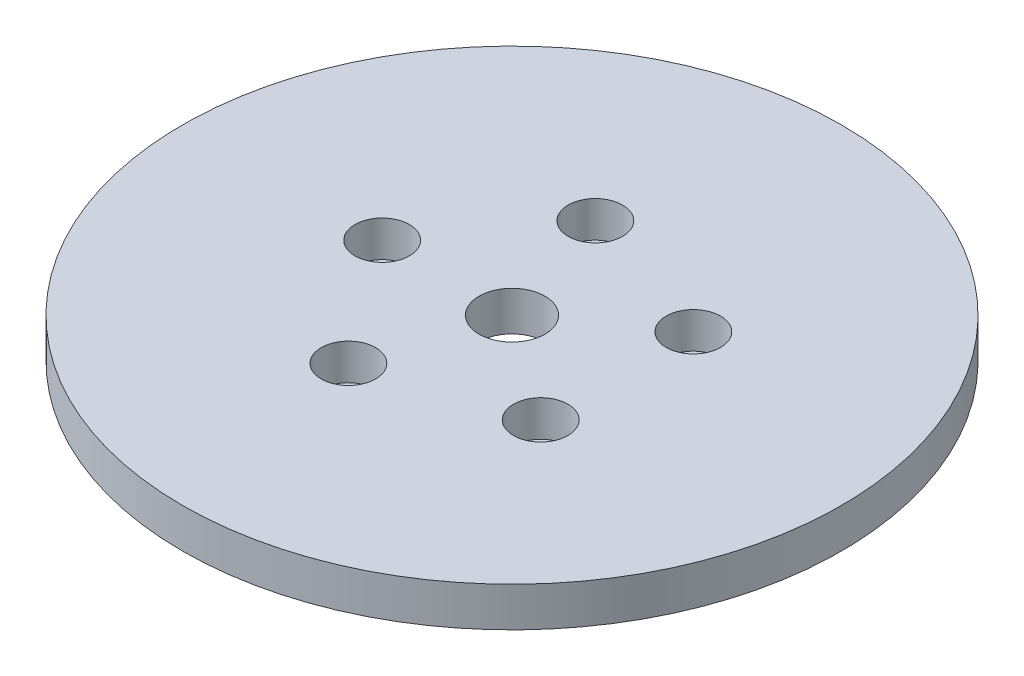
ISO-10303-21;
HEADER;
FILE_DESCRIPTION(('STEP AP214'),'2;1');
FILE_NAME('part.step','',(''),(''),'','','');
FILE_SCHEMA(('AUTOMOTIVE_DESIGN { 1 0 10303 214 1 1 1 1 }'));
ENDSEC;
DATA;
#1=APPLICATION_CONTEXT('core data for automotive mechanical design processes');
#2=APPLICATION_PROTOCOL_DEFINITION('international standard','automotive_design',2000,#1);
#3=PRODUCT_CONTEXT('',#1,'mechanical');
#4=PRODUCT('Part','Part','',(#3));
#5=PRODUCT_RELATED_PRODUCT_CATEGORY('part','',(#4));
#6=PRODUCT_DEFINITION_FORMATION('','',#4);
#7=PRODUCT_DEFINITION_CONTEXT('part definition',#1,'design');
#8=PRODUCT_DEFINITION('design','',#6,#7);
#9=PRODUCT_DEFINITION_SHAPE('','',#8);
#10=(LENGTH_UNIT() NAMED_UNIT(*) SI_UNIT(.MILLI.,.METRE.));
#11=(NAMED_UNIT(*) PLANE_ANGLE_UNIT() SI_UNIT($,.RADIAN.));
#12=(NAMED_UNIT(*) SI_UNIT($,.STERADIAN.) SOLID_ANGLE_UNIT());
#13=UNCERTAINTY_MEASURE_WITH_UNIT(LENGTH_MEASURE(1.E-05),#10,'distance_accuracy_value','');
#14=(GEOMETRIC_REPRESENTATION_CONTEXT(3) GLOBAL_UNCERTAINTY_ASSIGNED_CONTEXT((#13)) GLOBAL_UNIT_ASSIGNED_CONTEXT((#10,
#11,#12)) REPRESENTATION_CONTEXT('',''));
#15=CARTESIAN_POINT('',(0.,0.,0.));
#16=DIRECTION('',(0.,0.,1.));
#17=DIRECTION('',(1.,0.,0.));
#18=AXIS2_PLACEMENT_3D('',#15,#16,#17);
#19=CARTESIAN_POINT('',(0.,12.,0.));
#20=DIRECTION('',(0.,-1.,0.));
#21=DIRECTION('',(0.,0.,-1.));
#22=AXIS2_PLACEMENT_3D('',#19,#20,#21);
#23=CYLINDRICAL_SURFACE('',#22,100.);
#24=CARTESIAN_POINT('',(0.,12.,0.));
#25=DIRECTION('',(0.,1.,0.));
#26=DIRECTION('',(0.,0.,1.));
#27=AXIS2_PLACEMENT_3D('',#24,#25,#26);
#28=CIRCLE('',#27,100.);
#29=CARTESIAN_POINT('',(0.,12.,100.));
#30=VERTEX_POINT('',#29);
#31=EDGE_CURVE('E10',#30,#30,#28,.T.);
#32=ORIENTED_EDGE('',*,*,#31,.F.);
#33=EDGE_LOOP('',(#32));
#34=FACE_BOUND('',#33,.T.);
#35=CARTESIAN_POINT('',(0.,0.,0.));
#36=DIRECTION('',(0.,1.,0.));
#37=DIRECTION('',(0.,0.,1.));
#38=AXIS2_PLACEMENT_3D('',#35,#36,#37);
#39=CIRCLE('',#38,100.);
#40=CARTESIAN_POINT('',(0.,0.,100.));
#41=VERTEX_POINT('',#40);
#42=EDGE_CURVE('E37',#41,#41,#39,.T.);
#43=ORIENTED_EDGE('',*,*,#42,.T.);
#44=EDGE_LOOP('',(#43));
#45=FACE_BOUND('',#44,.T.);
#46=ADVANCED_FACE('F40',(#34,#45),#23,.T.);
#47=CARTESIAN_POINT('',(0.,12.,0.));
#48=DIRECTION('',(0.,1.,0.));
#49=DIRECTION('',(0.,0.,1.));
#50=AXIS2_PLACEMENT_3D('',#47,#48,#49);
#51=PLANE('',#50);
#52=CARTESIAN_POINT('',(-12.1738231960605,12.,-37.4671752349962));
#53=DIRECTION('',(0.,1.,0.));
#54=DIRECTION('',(-0.95105651629515,0.,0.309016994374958));
#55=AXIS2_PLACEMENT_3D('',#52,#53,#54);
#56=CIRCLE('',#55,8.24918257245908);
#57=CARTESIAN_POINT('',(-20.0192620357061,12.,-34.9180376304046));
#58=VERTEX_POINT('',#57);
#59=EDGE_CURVE('E70',#58,#58,#56,.T.);
#60=ORIENTED_EDGE('',*,*,#59,.F.);
#61=EDGE_LOOP('',(#60));
#62=FACE_BOUND('',#61,.T.);
#63=CARTESIAN_POINT('',(31.8714829003169,12.,-23.1559877576763));
#64=DIRECTION('',(0.,1.,0.));
#65=DIRECTION('',(-0.58778525229248,0.,-0.809016994374942));
#66=AXIS2_PLACEMENT_3D('',#63,#64,#65);
#67=CIRCLE('',#66,8.24918257245908);
#68=CARTESIAN_POINT('',(27.0227350407573,12.,-29.8297166484973));
#69=VERTEX_POINT('',#68);
#70=EDGE_CURVE('E71',#69,#69,#67,.T.);
#71=ORIENTED_EDGE('',*,*,#70,.F.);
#72=EDGE_LOOP('',(#71));
#73=FACE_BOUND('',#72,.T.);
#74=CARTESIAN_POINT('',(31.8714829003173,12.,23.1559877576759));
#75=DIRECTION('',(0.,1.,0.));
#76=DIRECTION('',(0.587785252292469,0.,-0.809016994374951));
#77=AXIS2_PLACEMENT_3D('',#74,#75,#76);
#78=CIRCLE('',#77,8.24918257245908);
#79=CARTESIAN_POINT('',(36.7202307598767,12.,16.4822588668548));
#80=VERTEX_POINT('',#79);
#81=EDGE_CURVE('E78',#80,#80,#78,.T.);
#82=ORIENTED_EDGE('',*,*,#81,.F.);
#83=EDGE_LOOP('',(#82));
#84=FACE_BOUND('',#83,.T.);
#85=CARTESIAN_POINT('',(-12.17382319606,12.,37.4671752349963));
#86=DIRECTION('',(0.,1.,0.));
#87=DIRECTION('',(0.951056516295155,0.,0.309016994374945));
#88=AXIS2_PLACEMENT_3D('',#85,#86,#87);
#89=CIRCLE('',#88,8.24918257245908);
#90=CARTESIAN_POINT('',(-4.32838435641433,12.,40.0163128395878));
#91=VERTEX_POINT('',#90);
#92=EDGE_CURVE('E61',#91,#91,#89,.T.);
#93=ORIENTED_EDGE('',*,*,#92,.F.);
#94=EDGE_LOOP('',(#93));
#95=FACE_BOUND('',#94,.T.);
#96=CARTESIAN_POINT('',(-39.3953194085141,12.,0.));
#97=DIRECTION('',(0.,1.,0.));
#98=DIRECTION('',(0.,0.,1.));
#99=AXIS2_PLACEMENT_3D('',#96,#97,#98);
#100=CIRCLE('',#99,8.24918257245908);
#101=CARTESIAN_POINT('',(-39.3953194085141,12.,8.24918257245908));
#102=VERTEX_POINT('',#101);
#103=EDGE_CURVE('E54',#102,#102,#100,.T.);
#104=ORIENTED_EDGE('',*,*,#103,.F.);
#105=EDGE_LOOP('',(#104));
#106=FACE_BOUND('',#105,.T.);
#107=CARTESIAN_POINT('',(0.,12.,0.));
#108=DIRECTION('',(0.,1.,0.));
#109=DIRECTION('',(0.,0.,1.));
#110=AXIS2_PLACEMENT_3D('',#107,#108,#109);
#111=CIRCLE('',#110,10.);
#112=CARTESIAN_POINT('',(0.,12.,10.));
#113=VERTEX_POINT('',#112);
#114=EDGE_CURVE('E50',#113,#113,#111,.T.);
#115=ORIENTED_EDGE('',*,*,#114,.F.);
#116=EDGE_LOOP('',(#115));
#117=FACE_BOUND('',#116,.T.);
#118=ORIENTED_EDGE('',*,*,#31,.T.);
#119=EDGE_LOOP('',(#118));
#120=FACE_BOUND('',#119,.T.);
#121=ADVANCED_FACE('F94',(#62,#73,#84,#95,#106,#117,#120),#51,.T.);
#122=CARTESIAN_POINT('',(0.,0.,0.));
#123=DIRECTION('',(0.,1.,0.));
#124=DIRECTION('',(0.,0.,1.));
#125=AXIS2_PLACEMENT_3D('',#122,#123,#124);
#126=PLANE('',#125);
#127=CARTESIAN_POINT('',(0.,0.,0.));
#128=DIRECTION('',(0.,1.,0.));
#129=DIRECTION('',(0.,0.,1.));
#130=AXIS2_PLACEMENT_3D('',#127,#128,#129);
#131=CIRCLE('',#130,10.);
#132=CARTESIAN_POINT('',(0.,0.,10.));
#133=VERTEX_POINT('',#132);
#134=EDGE_CURVE('E47',#133,#133,#131,.T.);
#135=ORIENTED_EDGE('',*,*,#134,.T.);
#136=EDGE_LOOP('',(#135));
#137=FACE_BOUND('',#136,.T.);
#138=ORIENTED_EDGE('',*,*,#42,.F.);
#139=EDGE_LOOP('',(#138));
#140=FACE_BOUND('',#139,.T.);
#141=ADVANCED_FACE('F100',(#137,#140),#126,.F.);
#142=CARTESIAN_POINT('',(0.,12.,0.));
#143=DIRECTION('',(0.,-1.,0.));
#144=DIRECTION('',(0.,0.,-1.));
#145=AXIS2_PLACEMENT_3D('',#142,#143,#144);
#146=CYLINDRICAL_SURFACE('',#145,10.);
#147=ORIENTED_EDGE('',*,*,#114,.T.);
#148=EDGE_LOOP('',(#147));
#149=FACE_BOUND('',#148,.T.);
#150=ORIENTED_EDGE('',*,*,#134,.F.);
#151=EDGE_LOOP('',(#150));
#152=FACE_BOUND('',#151,.T.);
#153=ADVANCED_FACE('F106',(#149,#152),#146,.F.);
#154=CARTESIAN_POINT('',(-39.3953194085141,1.06316625475435,0.));
#155=DIRECTION('',(0.,1.,0.));
#156=DIRECTION('',(0.,0.,1.));
#157=AXIS2_PLACEMENT_3D('',#154,#155,#156);
#158=CYLINDRICAL_SURFACE('',#157,8.24918257245908);
#159=CARTESIAN_POINT('',(-39.3953194085141,1.06316625475435,0.));
#160=DIRECTION('',(0.,1.,0.));
#161=DIRECTION('',(0.,0.,1.));
#162=AXIS2_PLACEMENT_3D('',#159,#160,#161);
#163=CIRCLE('',#162,8.24918257245908);
#164=CARTESIAN_POINT('',(-39.3953194085141,1.06316625475435,8.24918257245908));
#165=VERTEX_POINT('',#164);
#166=EDGE_CURVE('E55',#165,#165,#163,.T.);
#167=ORIENTED_EDGE('',*,*,#166,.F.);
#168=EDGE_LOOP('',(#167));
#169=FACE_BOUND('',#168,.T.);
#170=ORIENTED_EDGE('',*,*,#103,.T.);
#171=EDGE_LOOP('',(#170));
#172=FACE_BOUND('',#171,.T.);
#173=ADVANCED_FACE('F108',(#169,#172),#158,.F.);
#174=CARTESIAN_POINT('',(-39.3953194085141,1.06316625475435,0.));
#175=DIRECTION('',(0.,1.,0.));
#176=DIRECTION('',(0.,0.,1.));
#177=AXIS2_PLACEMENT_3D('',#174,#175,#176);
#178=PLANE('',#177);
#179=ORIENTED_EDGE('',*,*,#166,.T.);
#180=EDGE_LOOP('',(#179));
#181=FACE_BOUND('',#180,.T.);
#182=ADVANCED_FACE('F138',(#181),#178,.T.);
#183=CARTESIAN_POINT('',(-12.17382319606,1.06316625475435,37.4671752349963));
#184=DIRECTION('',(0.,1.,0.));
#185=DIRECTION('',(0.,0.,1.));
#186=AXIS2_PLACEMENT_3D('',#183,#184,#185);
#187=CYLINDRICAL_SURFACE('',#186,8.24918257245908);
#188=CARTESIAN_POINT('',(-12.17382319606,1.06316625475435,37.4671752349963));
#189=DIRECTION('',(0.,1.,0.));
#190=DIRECTION('',(0.951056516295155,0.,0.309016994374945));
#191=AXIS2_PLACEMENT_3D('',#188,#189,#190);
#192=CIRCLE('',#191,8.24918257245908);
#193=CARTESIAN_POINT('',(-4.32838435641433,1.06316625475435,40.0163128395878));
#194=VERTEX_POINT('',#193);
#195=EDGE_CURVE('E59',#194,#194,#192,.T.);
#196=ORIENTED_EDGE('',*,*,#195,.F.);
#197=EDGE_LOOP('',(#196));
#198=FACE_BOUND('',#197,.T.);
#199=ORIENTED_EDGE('',*,*,#92,.T.);
#200=EDGE_LOOP('',(#199));
#201=FACE_BOUND('',#200,.T.);
#202=ADVANCED_FACE('F150',(#198,#201),#187,.F.);
#203=CARTESIAN_POINT('',(-12.17382319606,1.06316625475435,37.4671752349963));
#204=DIRECTION('',(0.,1.,0.));
#205=DIRECTION('',(0.951056516295155,0.,0.309016994374945));
#206=AXIS2_PLACEMENT_3D('',#203,#204,#205);
#207=PLANE('',#206);
#208=ORIENTED_EDGE('',*,*,#195,.T.);
#209=EDGE_LOOP('',(#208));
#210=FACE_BOUND('',#209,.T.);
#211=ADVANCED_FACE('F89',(#210),#207,.T.);
#212=CARTESIAN_POINT('',(31.8714829003173,1.06316625475435,23.1559877576759));
#213=DIRECTION('',(0.,1.,0.));
#214=DIRECTION('',(0.,0.,1.));
#215=AXIS2_PLACEMENT_3D('',#212,#213,#214);
#216=CYLINDRICAL_SURFACE('',#215,8.24918257245908);
#217=CARTESIAN_POINT('',(31.8714829003173,1.06316625475435,23.1559877576759));
#218=DIRECTION('',(0.,1.,0.));
#219=DIRECTION('',(0.587785252292469,0.,-0.809016994374951));
#220=AXIS2_PLACEMENT_3D('',#217,#218,#219);
#221=CIRCLE('',#220,8.24918257245908);
#222=CARTESIAN_POINT('',(36.7202307598767,1.06316625475435,16.4822588668548));
#223=VERTEX_POINT('',#222);
#224=EDGE_CURVE('E63',#223,#223,#221,.T.);
#225=ORIENTED_EDGE('',*,*,#224,.F.);
#226=EDGE_LOOP('',(#225));
#227=FACE_BOUND('',#226,.T.);
#228=ORIENTED_EDGE('',*,*,#81,.T.);
#229=EDGE_LOOP('',(#228));
#230=FACE_BOUND('',#229,.T.);
#231=ADVANCED_FACE('F87',(#227,#230),#216,.F.);
#232=CARTESIAN_POINT('',(31.8714829003173,1.06316625475435,23.1559877576759));
#233=DIRECTION('',(0.,1.,0.));
#234=DIRECTION('',(0.587785252292469,0.,-0.809016994374951));
#235=AXIS2_PLACEMENT_3D('',#232,#233,#234);
#236=PLANE('',#235);
#237=ORIENTED_EDGE('',*,*,#224,.T.);
#238=EDGE_LOOP('',(#237));
#239=FACE_BOUND('',#238,.T.);
#240=ADVANCED_FACE('F84',(#239),#236,.T.);
#241=CARTESIAN_POINT('',(31.8714829003169,1.06316625475435,-23.1559877576763));
#242=DIRECTION('',(0.,1.,0.));
#243=DIRECTION('',(0.,0.,1.));
#244=AXIS2_PLACEMENT_3D('',#241,#242,#243);
#245=CYLINDRICAL_SURFACE('',#244,8.24918257245908);
#246=CARTESIAN_POINT('',(31.8714829003169,1.06316625475435,-23.1559877576763));
#247=DIRECTION('',(0.,1.,0.));
#248=DIRECTION('',(-0.58778525229248,0.,-0.809016994374942));
#249=AXIS2_PLACEMENT_3D('',#246,#247,#248);
#250=CIRCLE('',#249,8.24918257245908);
#251=CARTESIAN_POINT('',(27.0227350407573,1.06316625475435,-29.8297166484973));
#252=VERTEX_POINT('',#251);
#253=EDGE_CURVE('E76',#252,#252,#250,.T.);
#254=ORIENTED_EDGE('',*,*,#253,.F.);
#255=EDGE_LOOP('',(#254));
#256=FACE_BOUND('',#255,.T.);
#257=ORIENTED_EDGE('',*,*,#70,.T.);
#258=EDGE_LOOP('',(#257));
#259=FACE_BOUND('',#258,.T.);
#260=ADVANCED_FACE('F185',(#256,#259),#245,.F.);
#261=CARTESIAN_POINT('',(31.8714829003169,1.06316625475435,-23.1559877576763));
#262=DIRECTION('',(0.,1.,0.));
#263=DIRECTION('',(-0.58778525229248,0.,-0.809016994374942));
#264=AXIS2_PLACEMENT_3D('',#261,#262,#263);
#265=PLANE('',#264);
#266=ORIENTED_EDGE('',*,*,#253,.T.);
#267=EDGE_LOOP('',(#266));
#268=FACE_BOUND('',#267,.T.);
#269=ADVANCED_FACE('F189',(#268),#265,.T.);
#270=CARTESIAN_POINT('',(-12.1738231960605,1.06316625475435,-37.4671752349962));
#271=DIRECTION('',(0.,1.,0.));
#272=DIRECTION('',(0.,0.,1.));
#273=AXIS2_PLACEMENT_3D('',#270,#271,#272);
#274=CYLINDRICAL_SURFACE('',#273,8.24918257245908);
#275=CARTESIAN_POINT('',(-12.1738231960605,1.06316625475435,-37.4671752349962));
#276=DIRECTION('',(0.,1.,0.));
#277=DIRECTION('',(-0.95105651629515,0.,0.309016994374958));
#278=AXIS2_PLACEMENT_3D('',#275,#276,#277);
#279=CIRCLE('',#278,8.24918257245908);
#280=CARTESIAN_POINT('',(-20.0192620357061,1.06316625475435,-34.9180376304046));
#281=VERTEX_POINT('',#280);
#282=EDGE_CURVE('E69',#281,#281,#279,.T.);
#283=ORIENTED_EDGE('',*,*,#282,.F.);
#284=EDGE_LOOP('',(#283));
#285=FACE_BOUND('',#284,.T.);
#286=ORIENTED_EDGE('',*,*,#59,.T.);
#287=EDGE_LOOP('',(#286));
#288=FACE_BOUND('',#287,.T.);
#289=ADVANCED_FACE('F200',(#285,#288),#274,.F.);
#290=CARTESIAN_POINT('',(-12.1738231960605,1.06316625475435,-37.4671752349962));
#291=DIRECTION('',(0.,1.,0.));
#292=DIRECTION('',(-0.95105651629515,0.,0.309016994374958));
#293=AXIS2_PLACEMENT_3D('',#290,#291,#292);
#294=PLANE('',#293);
#295=ORIENTED_EDGE('',*,*,#282,.T.);
#296=EDGE_LOOP('',(#295));
#297=FACE_BOUND('',#296,.T.);
#298=ADVANCED_FACE('F208',(#297),#294,.T.);
#299=CLOSED_SHELL('',(#46,#121,#141,#153,#173,#182,#202,#211,#231,#240,#260,#269,#289,#298));
#300=MANIFOLD_SOLID_BREP('B2',#299);
#301=ADVANCED_BREP_SHAPE_REPRESENTATION('',(#18,#300),#14);
#302=SHAPE_DEFINITION_REPRESENTATION(#9,#301);
ENDSEC;
END-ISO-10303-21;
